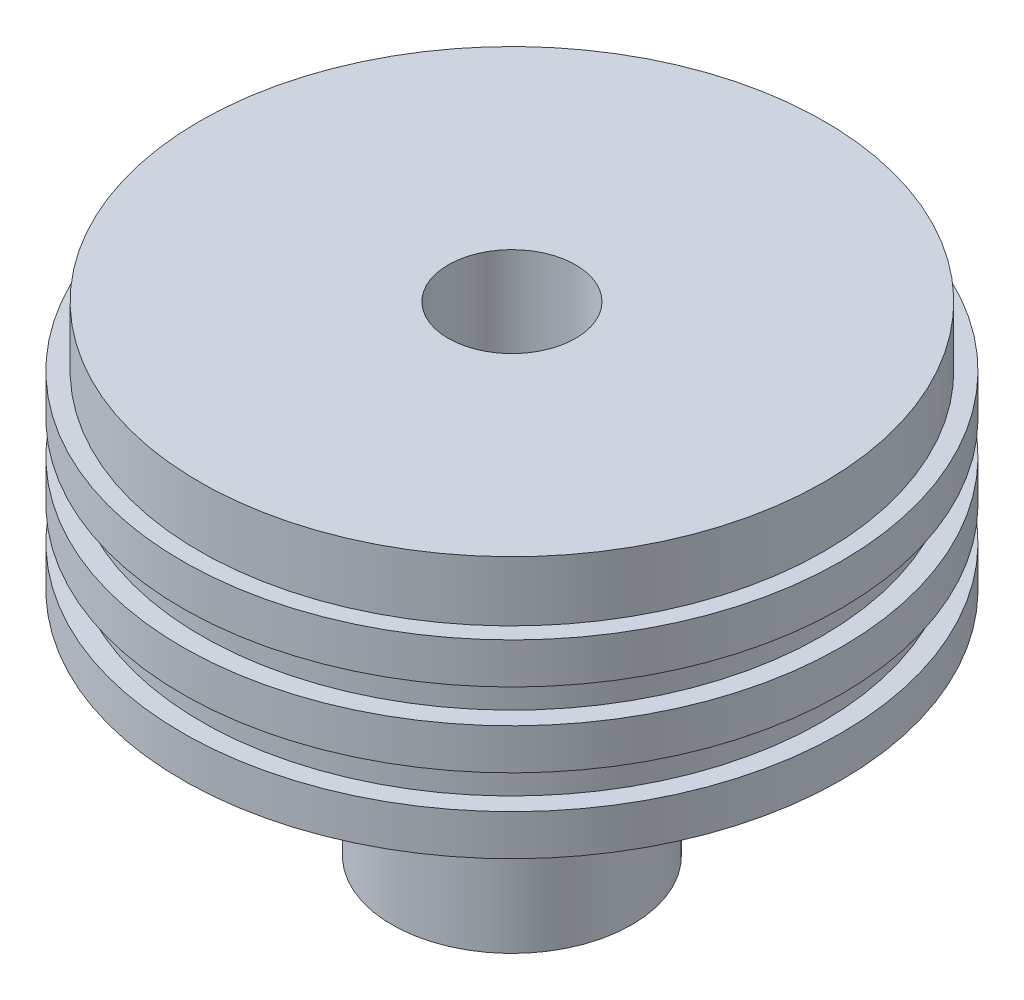
ISO-10303-21;
HEADER;
FILE_DESCRIPTION(('STEP AP214'),'2;1');
FILE_NAME('part.step','',(''),(''),'','','');
FILE_SCHEMA(('AUTOMOTIVE_DESIGN { 1 0 10303 214 1 1 1 1 }'));
ENDSEC;
DATA;
#1=APPLICATION_CONTEXT('core data for automotive mechanical design processes');
#2=APPLICATION_PROTOCOL_DEFINITION('international standard','automotive_design',2000,#1);
#3=PRODUCT_CONTEXT('',#1,'mechanical');
#4=PRODUCT('Part','Part','',(#3));
#5=PRODUCT_RELATED_PRODUCT_CATEGORY('part','',(#4));
#6=PRODUCT_DEFINITION_FORMATION('','',#4);
#7=PRODUCT_DEFINITION_CONTEXT('part definition',#1,'design');
#8=PRODUCT_DEFINITION('design','',#6,#7);
#9=PRODUCT_DEFINITION_SHAPE('','',#8);
#10=(LENGTH_UNIT() NAMED_UNIT(*) SI_UNIT(.MILLI.,.METRE.));
#11=(NAMED_UNIT(*) PLANE_ANGLE_UNIT() SI_UNIT($,.RADIAN.));
#12=(NAMED_UNIT(*) SI_UNIT($,.STERADIAN.) SOLID_ANGLE_UNIT());
#13=UNCERTAINTY_MEASURE_WITH_UNIT(LENGTH_MEASURE(1.E-05),#10,'distance_accuracy_value','');
#14=(GEOMETRIC_REPRESENTATION_CONTEXT(3) GLOBAL_UNCERTAINTY_ASSIGNED_CONTEXT((#13)) GLOBAL_UNIT_ASSIGNED_CONTEXT((#10,
#11,#12)) REPRESENTATION_CONTEXT('',''));
#15=CARTESIAN_POINT('',(0.,0.,0.));
#16=DIRECTION('',(0.,0.,1.));
#17=DIRECTION('',(1.,0.,0.));
#18=AXIS2_PLACEMENT_3D('',#15,#16,#17);
#19=CARTESIAN_POINT('',(0.,-24.384,0.));
#20=DIRECTION('',(0.,1.,0.));
#21=DIRECTION('',(-1.,0.,0.));
#22=AXIS2_PLACEMENT_3D('',#19,#20,#21);
#23=PLANE('',#22);
#24=CARTESIAN_POINT('',(0.,-24.384,0.));
#25=DIRECTION('',(0.,1.,0.));
#26=DIRECTION('',(0.,0.,1.));
#27=AXIS2_PLACEMENT_3D('',#24,#25,#26);
#28=CIRCLE('',#27,6.74623999999999);
#29=CARTESIAN_POINT('',(0.,-24.384,6.74623999999999));
#30=VERTEX_POINT('',#29);
#31=EDGE_CURVE('E108',#30,#30,#28,.T.);
#32=ORIENTED_EDGE('',*,*,#31,.T.);
#33=EDGE_LOOP('',(#32));
#34=FACE_BOUND('',#33,.T.);
#35=CARTESIAN_POINT('',(0.,-24.384,0.));
#36=DIRECTION('',(0.,-1.,0.));
#37=DIRECTION('',(1.,0.,0.));
#38=AXIS2_PLACEMENT_3D('',#35,#36,#37);
#39=CIRCLE('',#38,12.7);
#40=CARTESIAN_POINT('',(12.7,-24.384,0.));
#41=VERTEX_POINT('',#40);
#42=EDGE_CURVE('E10',#41,#41,#39,.T.);
#43=ORIENTED_EDGE('',*,*,#42,.T.);
#44=EDGE_LOOP('',(#43));
#45=FACE_BOUND('',#44,.T.);
#46=ADVANCED_FACE('F45',(#34,#45),#23,.F.);
#47=CARTESIAN_POINT('',(0.,0.,0.));
#48=DIRECTION('',(0.,-1.,0.));
#49=DIRECTION('',(1.,0.,0.));
#50=AXIS2_PLACEMENT_3D('',#47,#48,#49);
#51=CYLINDRICAL_SURFACE('',#50,12.7);
#52=ORIENTED_EDGE('',*,*,#42,.F.);
#53=EDGE_LOOP('',(#52));
#54=FACE_BOUND('',#53,.T.);
#55=CARTESIAN_POINT('',(0.,0.,0.));
#56=DIRECTION('',(0.,-1.,0.));
#57=DIRECTION('',(1.,0.,0.));
#58=AXIS2_PLACEMENT_3D('',#55,#56,#57);
#59=CIRCLE('',#58,12.7);
#60=CARTESIAN_POINT('',(12.7,0.,0.));
#61=VERTEX_POINT('',#60);
#62=EDGE_CURVE('E52',#61,#61,#59,.T.);
#63=ORIENTED_EDGE('',*,*,#62,.T.);
#64=EDGE_LOOP('',(#63));
#65=FACE_BOUND('',#64,.T.);
#66=ADVANCED_FACE('F138',(#54,#65),#51,.T.);
#67=CARTESIAN_POINT('',(-12.7,0.,0.));
#68=DIRECTION('',(0.,1.,0.));
#69=DIRECTION('',(-1.,0.,0.));
#70=AXIS2_PLACEMENT_3D('',#67,#68,#69);
#71=PLANE('',#70);
#72=ORIENTED_EDGE('',*,*,#62,.F.);
#73=EDGE_LOOP('',(#72));
#74=FACE_BOUND('',#73,.T.);
#75=CARTESIAN_POINT('',(0.,0.,0.));
#76=DIRECTION('',(0.,-1.,0.));
#77=DIRECTION('',(1.,0.,0.));
#78=AXIS2_PLACEMENT_3D('',#75,#76,#77);
#79=CIRCLE('',#78,34.8996);
#80=CARTESIAN_POINT('',(34.8996,0.,0.));
#81=VERTEX_POINT('',#80);
#82=EDGE_CURVE('E57',#81,#81,#79,.T.);
#83=ORIENTED_EDGE('',*,*,#82,.T.);
#84=EDGE_LOOP('',(#83));
#85=FACE_BOUND('',#84,.T.);
#86=ADVANCED_FACE('F143',(#74,#85),#71,.F.);
#87=CARTESIAN_POINT('',(0.,0.,0.));
#88=DIRECTION('',(0.,-1.,0.));
#89=DIRECTION('',(1.,0.,0.));
#90=AXIS2_PLACEMENT_3D('',#87,#88,#89);
#91=CYLINDRICAL_SURFACE('',#90,34.8996);
#92=ORIENTED_EDGE('',*,*,#82,.F.);
#93=EDGE_LOOP('',(#92));
#94=FACE_BOUND('',#93,.T.);
#95=CARTESIAN_POINT('',(0.,4.318,0.));
#96=DIRECTION('',(0.,-1.,0.));
#97=DIRECTION('',(1.,0.,0.));
#98=AXIS2_PLACEMENT_3D('',#95,#96,#97);
#99=CIRCLE('',#98,34.8996);
#100=CARTESIAN_POINT('',(34.8996,4.318,0.));
#101=VERTEX_POINT('',#100);
#102=EDGE_CURVE('E62',#101,#101,#99,.T.);
#103=ORIENTED_EDGE('',*,*,#102,.T.);
#104=EDGE_LOOP('',(#103));
#105=FACE_BOUND('',#104,.T.);
#106=ADVANCED_FACE('F259',(#94,#105),#91,.T.);
#107=CARTESIAN_POINT('',(-32.8676,4.318,0.));
#108=DIRECTION('',(0.,-1.,0.));
#109=DIRECTION('',(1.,0.,0.));
#110=AXIS2_PLACEMENT_3D('',#107,#108,#109);
#111=PLANE('',#110);
#112=ORIENTED_EDGE('',*,*,#102,.F.);
#113=EDGE_LOOP('',(#112));
#114=FACE_BOUND('',#113,.T.);
#115=CARTESIAN_POINT('',(0.,4.318,0.));
#116=DIRECTION('',(0.,-1.,0.));
#117=DIRECTION('',(1.,0.,0.));
#118=AXIS2_PLACEMENT_3D('',#115,#116,#117);
#119=CIRCLE('',#118,32.8676);
#120=CARTESIAN_POINT('',(32.8676,4.318,0.));
#121=VERTEX_POINT('',#120);
#122=EDGE_CURVE('E68',#121,#121,#119,.T.);
#123=ORIENTED_EDGE('',*,*,#122,.T.);
#124=EDGE_LOOP('',(#123));
#125=FACE_BOUND('',#124,.T.);
#126=ADVANCED_FACE('F249',(#114,#125),#111,.F.);
#127=CARTESIAN_POINT('',(0.,0.,0.));
#128=DIRECTION('',(0.,-1.,0.));
#129=DIRECTION('',(1.,0.,0.));
#130=AXIS2_PLACEMENT_3D('',#127,#128,#129);
#131=CYLINDRICAL_SURFACE('',#130,32.8676);
#132=ORIENTED_EDGE('',*,*,#122,.F.);
#133=EDGE_LOOP('',(#132));
#134=FACE_BOUND('',#133,.T.);
#135=CARTESIAN_POINT('',(0.,7.874,0.));
#136=DIRECTION('',(0.,-1.,0.));
#137=DIRECTION('',(1.,0.,0.));
#138=AXIS2_PLACEMENT_3D('',#135,#136,#137);
#139=CIRCLE('',#138,32.8676);
#140=CARTESIAN_POINT('',(32.8676,7.874,0.));
#141=VERTEX_POINT('',#140);
#142=EDGE_CURVE('E72',#141,#141,#139,.T.);
#143=ORIENTED_EDGE('',*,*,#142,.T.);
#144=EDGE_LOOP('',(#143));
#145=FACE_BOUND('',#144,.T.);
#146=ADVANCED_FACE('F239',(#134,#145),#131,.T.);
#147=CARTESIAN_POINT('',(-32.8676,7.874,0.));
#148=DIRECTION('',(0.,1.,0.));
#149=DIRECTION('',(-1.,0.,0.));
#150=AXIS2_PLACEMENT_3D('',#147,#148,#149);
#151=PLANE('',#150);
#152=ORIENTED_EDGE('',*,*,#142,.F.);
#153=EDGE_LOOP('',(#152));
#154=FACE_BOUND('',#153,.T.);
#155=CARTESIAN_POINT('',(0.,7.874,0.));
#156=DIRECTION('',(0.,-1.,0.));
#157=DIRECTION('',(1.,0.,0.));
#158=AXIS2_PLACEMENT_3D('',#155,#156,#157);
#159=CIRCLE('',#158,34.8996);
#160=CARTESIAN_POINT('',(34.8996,7.874,0.));
#161=VERTEX_POINT('',#160);
#162=EDGE_CURVE('E76',#161,#161,#159,.T.);
#163=ORIENTED_EDGE('',*,*,#162,.T.);
#164=EDGE_LOOP('',(#163));
#165=FACE_BOUND('',#164,.T.);
#166=ADVANCED_FACE('F229',(#154,#165),#151,.F.);
#167=CARTESIAN_POINT('',(0.,0.,0.));
#168=DIRECTION('',(0.,-1.,0.));
#169=DIRECTION('',(1.,0.,0.));
#170=AXIS2_PLACEMENT_3D('',#167,#168,#169);
#171=CYLINDRICAL_SURFACE('',#170,34.8996);
#172=ORIENTED_EDGE('',*,*,#162,.F.);
#173=EDGE_LOOP('',(#172));
#174=FACE_BOUND('',#173,.T.);
#175=CARTESIAN_POINT('',(0.,12.192,0.));
#176=DIRECTION('',(0.,-1.,0.));
#177=DIRECTION('',(1.,0.,0.));
#178=AXIS2_PLACEMENT_3D('',#175,#176,#177);
#179=CIRCLE('',#178,34.8996);
#180=CARTESIAN_POINT('',(34.8996,12.192,0.));
#181=VERTEX_POINT('',#180);
#182=EDGE_CURVE('E80',#181,#181,#179,.T.);
#183=ORIENTED_EDGE('',*,*,#182,.T.);
#184=EDGE_LOOP('',(#183));
#185=FACE_BOUND('',#184,.T.);
#186=ADVANCED_FACE('F219',(#174,#185),#171,.T.);
#187=CARTESIAN_POINT('',(-34.8996,12.192,0.));
#188=DIRECTION('',(0.,-1.,0.));
#189=DIRECTION('',(1.,0.,0.));
#190=AXIS2_PLACEMENT_3D('',#187,#188,#189);
#191=PLANE('',#190);
#192=ORIENTED_EDGE('',*,*,#182,.F.);
#193=EDGE_LOOP('',(#192));
#194=FACE_BOUND('',#193,.T.);
#195=CARTESIAN_POINT('',(0.,12.192,0.));
#196=DIRECTION('',(0.,-1.,0.));
#197=DIRECTION('',(1.,0.,0.));
#198=AXIS2_PLACEMENT_3D('',#195,#196,#197);
#199=CIRCLE('',#198,32.8676);
#200=CARTESIAN_POINT('',(32.8676,12.192,0.));
#201=VERTEX_POINT('',#200);
#202=EDGE_CURVE('E84',#201,#201,#199,.T.);
#203=ORIENTED_EDGE('',*,*,#202,.T.);
#204=EDGE_LOOP('',(#203));
#205=FACE_BOUND('',#204,.T.);
#206=ADVANCED_FACE('F209',(#194,#205),#191,.F.);
#207=CARTESIAN_POINT('',(0.,0.,0.));
#208=DIRECTION('',(0.,-1.,0.));
#209=DIRECTION('',(1.,0.,0.));
#210=AXIS2_PLACEMENT_3D('',#207,#208,#209);
#211=CYLINDRICAL_SURFACE('',#210,32.8676);
#212=ORIENTED_EDGE('',*,*,#202,.F.);
#213=EDGE_LOOP('',(#212));
#214=FACE_BOUND('',#213,.T.);
#215=CARTESIAN_POINT('',(0.,15.748,0.));
#216=DIRECTION('',(0.,-1.,0.));
#217=DIRECTION('',(1.,0.,0.));
#218=AXIS2_PLACEMENT_3D('',#215,#216,#217);
#219=CIRCLE('',#218,32.8676);
#220=CARTESIAN_POINT('',(32.8676,15.748,0.));
#221=VERTEX_POINT('',#220);
#222=EDGE_CURVE('E88',#221,#221,#219,.T.);
#223=ORIENTED_EDGE('',*,*,#222,.T.);
#224=EDGE_LOOP('',(#223));
#225=FACE_BOUND('',#224,.T.);
#226=ADVANCED_FACE('F199',(#214,#225),#211,.T.);
#227=CARTESIAN_POINT('',(-34.8996,15.748,0.));
#228=DIRECTION('',(0.,1.,0.));
#229=DIRECTION('',(-1.,0.,0.));
#230=AXIS2_PLACEMENT_3D('',#227,#228,#229);
#231=PLANE('',#230);
#232=ORIENTED_EDGE('',*,*,#222,.F.);
#233=EDGE_LOOP('',(#232));
#234=FACE_BOUND('',#233,.T.);
#235=CARTESIAN_POINT('',(0.,15.748,0.));
#236=DIRECTION('',(0.,-1.,0.));
#237=DIRECTION('',(1.,0.,0.));
#238=AXIS2_PLACEMENT_3D('',#235,#236,#237);
#239=CIRCLE('',#238,34.8996);
#240=CARTESIAN_POINT('',(34.8996,15.748,0.));
#241=VERTEX_POINT('',#240);
#242=EDGE_CURVE('E92',#241,#241,#239,.T.);
#243=ORIENTED_EDGE('',*,*,#242,.T.);
#244=EDGE_LOOP('',(#243));
#245=FACE_BOUND('',#244,.T.);
#246=ADVANCED_FACE('F189',(#234,#245),#231,.F.);
#247=CARTESIAN_POINT('',(0.,0.,0.));
#248=DIRECTION('',(0.,-1.,0.));
#249=DIRECTION('',(1.,0.,0.));
#250=AXIS2_PLACEMENT_3D('',#247,#248,#249);
#251=CYLINDRICAL_SURFACE('',#250,34.8996);
#252=ORIENTED_EDGE('',*,*,#242,.F.);
#253=EDGE_LOOP('',(#252));
#254=FACE_BOUND('',#253,.T.);
#255=CARTESIAN_POINT('',(0.,20.066,0.));
#256=DIRECTION('',(0.,-1.,0.));
#257=DIRECTION('',(1.,0.,0.));
#258=AXIS2_PLACEMENT_3D('',#255,#256,#257);
#259=CIRCLE('',#258,34.8996);
#260=CARTESIAN_POINT('',(34.8996,20.066,0.));
#261=VERTEX_POINT('',#260);
#262=EDGE_CURVE('E96',#261,#261,#259,.T.);
#263=ORIENTED_EDGE('',*,*,#262,.T.);
#264=EDGE_LOOP('',(#263));
#265=FACE_BOUND('',#264,.T.);
#266=ADVANCED_FACE('F133',(#254,#265),#251,.T.);
#267=CARTESIAN_POINT('',(-33.0835,20.066,0.));
#268=DIRECTION('',(0.,-1.,0.));
#269=DIRECTION('',(1.,0.,0.));
#270=AXIS2_PLACEMENT_3D('',#267,#268,#269);
#271=PLANE('',#270);
#272=ORIENTED_EDGE('',*,*,#262,.F.);
#273=EDGE_LOOP('',(#272));
#274=FACE_BOUND('',#273,.T.);
#275=CARTESIAN_POINT('',(0.,20.066,0.));
#276=DIRECTION('',(0.,-1.,0.));
#277=DIRECTION('',(1.,0.,0.));
#278=AXIS2_PLACEMENT_3D('',#275,#276,#277);
#279=CIRCLE('',#278,33.0835);
#280=CARTESIAN_POINT('',(33.0835,20.066,0.));
#281=VERTEX_POINT('',#280);
#282=EDGE_CURVE('E100',#281,#281,#279,.T.);
#283=ORIENTED_EDGE('',*,*,#282,.T.);
#284=EDGE_LOOP('',(#283));
#285=FACE_BOUND('',#284,.T.);
#286=ADVANCED_FACE('F127',(#274,#285),#271,.F.);
#287=CARTESIAN_POINT('',(0.,0.,0.));
#288=DIRECTION('',(0.,-1.,0.));
#289=DIRECTION('',(1.,0.,0.));
#290=AXIS2_PLACEMENT_3D('',#287,#288,#289);
#291=CYLINDRICAL_SURFACE('',#290,33.0835);
#292=ORIENTED_EDGE('',*,*,#282,.F.);
#293=EDGE_LOOP('',(#292));
#294=FACE_BOUND('',#293,.T.);
#295=CARTESIAN_POINT('',(0.,26.416,0.));
#296=DIRECTION('',(0.,-1.,0.));
#297=DIRECTION('',(1.,0.,0.));
#298=AXIS2_PLACEMENT_3D('',#295,#296,#297);
#299=CIRCLE('',#298,33.0835);
#300=CARTESIAN_POINT('',(33.0835,26.416,0.));
#301=VERTEX_POINT('',#300);
#302=EDGE_CURVE('E104',#301,#301,#299,.T.);
#303=ORIENTED_EDGE('',*,*,#302,.T.);
#304=EDGE_LOOP('',(#303));
#305=FACE_BOUND('',#304,.T.);
#306=ADVANCED_FACE('F122',(#294,#305),#291,.T.);
#307=CARTESIAN_POINT('',(0.,26.416,0.));
#308=DIRECTION('',(0.,-1.,0.));
#309=DIRECTION('',(1.,0.,0.));
#310=AXIS2_PLACEMENT_3D('',#307,#308,#309);
#311=PLANE('',#310);
#312=CARTESIAN_POINT('',(0.,26.416,0.));
#313=DIRECTION('',(0.,1.,0.));
#314=DIRECTION('',(0.,0.,1.));
#315=AXIS2_PLACEMENT_3D('',#312,#313,#314);
#316=CIRCLE('',#315,6.74623999999999);
#317=CARTESIAN_POINT('',(0.,26.416,6.74623999999999));
#318=VERTEX_POINT('',#317);
#319=EDGE_CURVE('E112',#318,#318,#316,.T.);
#320=ORIENTED_EDGE('',*,*,#319,.F.);
#321=EDGE_LOOP('',(#320));
#322=FACE_BOUND('',#321,.T.);
#323=ORIENTED_EDGE('',*,*,#302,.F.);
#324=EDGE_LOOP('',(#323));
#325=FACE_BOUND('',#324,.T.);
#326=ADVANCED_FACE('F119',(#322,#325),#311,.F.);
#327=CARTESIAN_POINT('',(0.,26.416,0.));
#328=DIRECTION('',(0.,1.,0.));
#329=DIRECTION('',(0.,0.,1.));
#330=AXIS2_PLACEMENT_3D('',#327,#328,#329);
#331=CYLINDRICAL_SURFACE('',#330,6.74623999999999);
#332=ORIENTED_EDGE('',*,*,#31,.F.);
#333=EDGE_LOOP('',(#332));
#334=FACE_BOUND('',#333,.T.);
#335=ORIENTED_EDGE('',*,*,#319,.T.);
#336=EDGE_LOOP('',(#335));
#337=FACE_BOUND('',#336,.T.);
#338=ADVANCED_FACE('F117',(#334,#337),#331,.F.);
#339=CLOSED_SHELL('',(#46,#66,#86,#106,#126,#146,#166,#186,#206,#226,#246,#266,#286,#306,#326,#338));
#340=MANIFOLD_SOLID_BREP('B2',#339);
#341=ADVANCED_BREP_SHAPE_REPRESENTATION('',(#18,#340),#14);
#342=SHAPE_DEFINITION_REPRESENTATION(#9,#341);
ENDSEC;
END-ISO-10303-21;
